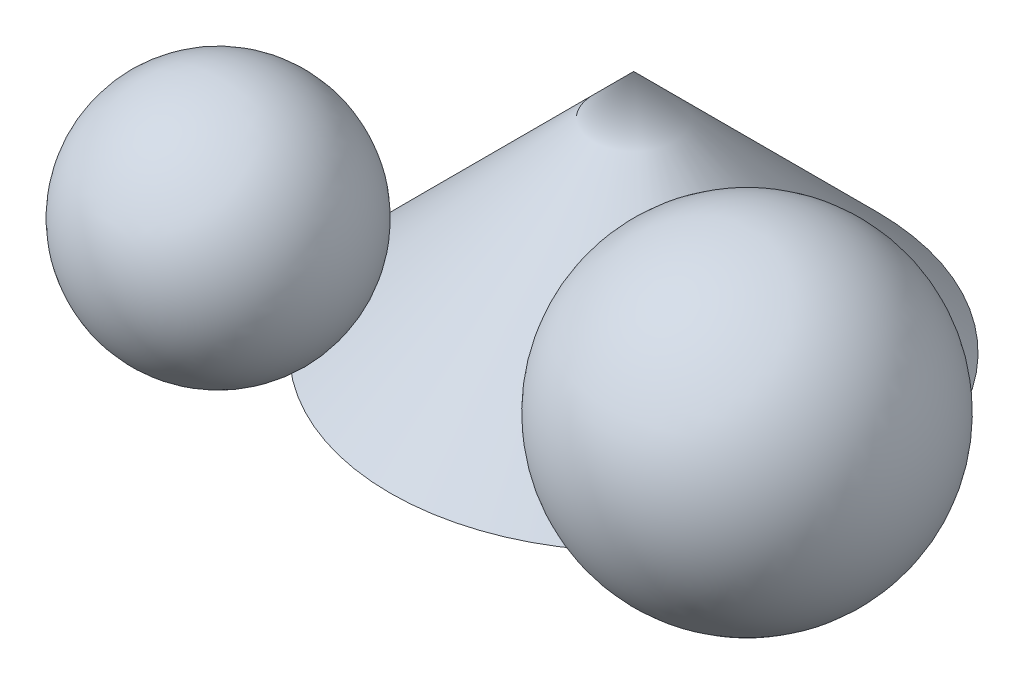
ISO-10303-21;
HEADER;
FILE_DESCRIPTION(('STEP AP214'),'2;1');
FILE_NAME('part.step','',(''),(''),'','','');
FILE_SCHEMA(('AUTOMOTIVE_DESIGN { 1 0 10303 214 1 1 1 1 }'));
ENDSEC;
DATA;
#1=APPLICATION_CONTEXT('core data for automotive mechanical design processes');
#2=APPLICATION_PROTOCOL_DEFINITION('international standard','automotive_design',2000,#1);
#3=PRODUCT_CONTEXT('',#1,'mechanical');
#4=PRODUCT('Part','Part','',(#3));
#5=PRODUCT_RELATED_PRODUCT_CATEGORY('part','',(#4));
#6=PRODUCT_DEFINITION_FORMATION('','',#4);
#7=PRODUCT_DEFINITION_CONTEXT('part definition',#1,'design');
#8=PRODUCT_DEFINITION('design','',#6,#7);
#9=PRODUCT_DEFINITION_SHAPE('','',#8);
#10=(LENGTH_UNIT() NAMED_UNIT(*) SI_UNIT(.MILLI.,.METRE.));
#11=(NAMED_UNIT(*) PLANE_ANGLE_UNIT() SI_UNIT($,.RADIAN.));
#12=(NAMED_UNIT(*) SI_UNIT($,.STERADIAN.) SOLID_ANGLE_UNIT());
#13=UNCERTAINTY_MEASURE_WITH_UNIT(LENGTH_MEASURE(1.E-05),#10,'distance_accuracy_value','');
#14=(GEOMETRIC_REPRESENTATION_CONTEXT(3) GLOBAL_UNCERTAINTY_ASSIGNED_CONTEXT((#13)) GLOBAL_UNIT_ASSIGNED_CONTEXT((#10,
#11,#12)) REPRESENTATION_CONTEXT('',''));
#15=CARTESIAN_POINT('',(0.,0.,0.));
#16=DIRECTION('',(0.,0.,1.));
#17=DIRECTION('',(1.,0.,0.));
#18=AXIS2_PLACEMENT_3D('',#15,#16,#17);
#19=CARTESIAN_POINT('',(44.0328312605943,26.1815038137328,25.4223669814855));
#20=DIRECTION('',(0.,1.,0.));
#21=DIRECTION('',(0.866025403784438,0.,0.500000000000001));
#22=AXIS2_PLACEMENT_3D('',#19,#20,#21);
#23=SPHERICAL_SURFACE('',#22,26.1815038137328);
#24=CARTESIAN_POINT('',(44.0328312605943,52.3630076274656,25.4223669814855));
#25=VERTEX_POINT('',#24);
#26=VERTEX_LOOP('',#25);
#27=FACE_BOUND('',#26,.T.);
#28=ADVANCED_FACE('F34',(#27),#23,.T.);
#29=CLOSED_SHELL('',(#28));
#30=MANIFOLD_SOLID_BREP('B2',#29);
#31=CARTESIAN_POINT('',(-33.2621534164353,20.,35.));
#32=DIRECTION('',(0.,0.,1.));
#33=DIRECTION('',(-1.,0.,0.));
#34=AXIS2_PLACEMENT_3D('',#31,#32,#33);
#35=SPHERICAL_SURFACE('',#34,20.);
#36=CARTESIAN_POINT('',(-33.2621534164353,20.,55.));
#37=VERTEX_POINT('',#36);
#38=VERTEX_LOOP('',#37);
#39=FACE_BOUND('',#38,.T.);
#40=ADVANCED_FACE('F55',(#39),#35,.T.);
#41=CLOSED_SHELL('',(#40));
#42=MANIFOLD_SOLID_BREP('B7',#41);
#43=CARTESIAN_POINT('',(0.,0.,0.));
#44=DIRECTION('',(0.,1.,0.));
#45=DIRECTION('',(0.,0.,1.));
#46=AXIS2_PLACEMENT_3D('',#43,#44,#45);
#47=PLANE('',#46);
#48=CARTESIAN_POINT('',(0.,0.,0.));
#49=DIRECTION('',(0.,1.,0.));
#50=DIRECTION('',(0.,0.,1.));
#51=AXIS2_PLACEMENT_3D('',#48,#49,#50);
#52=CIRCLE('',#51,40.);
#53=CARTESIAN_POINT('',(0.,0.,40.));
#54=VERTEX_POINT('',#53);
#55=EDGE_CURVE('E53',#54,#54,#52,.T.);
#56=ORIENTED_EDGE('',*,*,#55,.F.);
#57=EDGE_LOOP('',(#56));
#58=FACE_BOUND('',#57,.T.);
#59=ADVANCED_FACE('F67',(#58),#47,.F.);
#60=CARTESIAN_POINT('',(0.,40.,0.));
#61=DIRECTION('',(0.,-1.,0.));
#62=DIRECTION('',(0.,0.,-1.));
#63=AXIS2_PLACEMENT_3D('',#60,#61,#62);
#64=CONICAL_SURFACE('',#63,0.,0.785398163397448);
#65=ORIENTED_EDGE('',*,*,#55,.T.);
#66=EDGE_LOOP('',(#65));
#67=FACE_BOUND('',#66,.T.);
#68=CARTESIAN_POINT('',(0.,40.,0.));
#69=VERTEX_POINT('',#68);
#70=VERTEX_LOOP('',#69);
#71=FACE_BOUND('',#70,.T.);
#72=ADVANCED_FACE('F77',(#67,#71),#64,.T.);
#73=CLOSED_SHELL('',(#59,#72));
#74=MANIFOLD_SOLID_BREP('B30',#73);
#75=ADVANCED_BREP_SHAPE_REPRESENTATION('',(#18,#30,#42,#74),#14);
#76=SHAPE_DEFINITION_REPRESENTATION(#9,#75);
ENDSEC;
END-ISO-10303-21;
